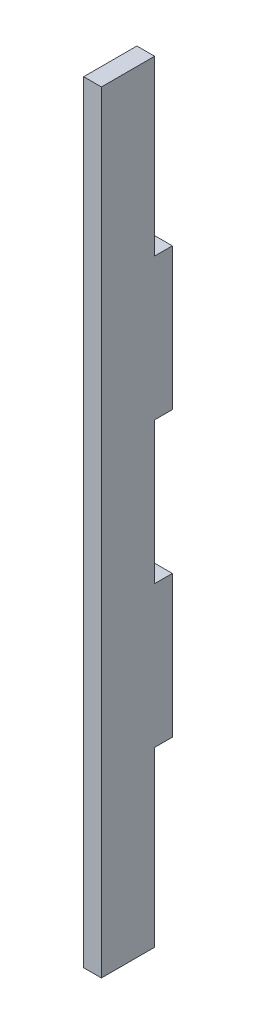
ISO-10303-21;
HEADER;
FILE_DESCRIPTION(('STEP AP214'),'2;1');
FILE_NAME('part.step','',(''),(''),'','','');
FILE_SCHEMA(('AUTOMOTIVE_DESIGN { 1 0 10303 214 1 1 1 1 }'));
ENDSEC;
DATA;
#1=APPLICATION_CONTEXT('core data for automotive mechanical design processes');
#2=APPLICATION_PROTOCOL_DEFINITION('international standard','automotive_design',2000,#1);
#3=PRODUCT_CONTEXT('',#1,'mechanical');
#4=PRODUCT('Part','Part','',(#3));
#5=PRODUCT_RELATED_PRODUCT_CATEGORY('part','',(#4));
#6=PRODUCT_DEFINITION_FORMATION('','',#4);
#7=PRODUCT_DEFINITION_CONTEXT('part definition',#1,'design');
#8=PRODUCT_DEFINITION('design','',#6,#7);
#9=PRODUCT_DEFINITION_SHAPE('','',#8);
#10=(LENGTH_UNIT() NAMED_UNIT(*) SI_UNIT(.MILLI.,.METRE.));
#11=(NAMED_UNIT(*) PLANE_ANGLE_UNIT() SI_UNIT($,.RADIAN.));
#12=(NAMED_UNIT(*) SI_UNIT($,.STERADIAN.) SOLID_ANGLE_UNIT());
#13=UNCERTAINTY_MEASURE_WITH_UNIT(LENGTH_MEASURE(1.E-05),#10,'distance_accuracy_value','');
#14=(GEOMETRIC_REPRESENTATION_CONTEXT(3) GLOBAL_UNCERTAINTY_ASSIGNED_CONTEXT((#13)) GLOBAL_UNIT_ASSIGNED_CONTEXT((#10,
#11,#12)) REPRESENTATION_CONTEXT('',''));
#15=CARTESIAN_POINT('',(0.,0.,0.));
#16=DIRECTION('',(0.,0.,1.));
#17=DIRECTION('',(1.,0.,0.));
#18=AXIS2_PLACEMENT_3D('',#15,#16,#17);
#19=CARTESIAN_POINT('',(3.175,0.,-3.175));
#20=DIRECTION('',(0.,0.,-1.));
#21=DIRECTION('',(-1.,0.,0.));
#22=AXIS2_PLACEMENT_3D('',#19,#20,#21);
#23=PLANE('',#22);
#24=DIRECTION('',(0.,-1.,0.));
#25=VECTOR('',#24,1.);
#26=CARTESIAN_POINT('',(0.,0.,-3.175));
#27=LINE('',#26,#25);
#28=CARTESIAN_POINT('',(0.,-101.6,-3.17500000000001));
#29=VERTEX_POINT('',#28);
#30=CARTESIAN_POINT('',(0.,-132.588,-3.175));
#31=VERTEX_POINT('',#30);
#32=EDGE_CURVE('E152',#29,#31,#27,.T.);
#33=ORIENTED_EDGE('',*,*,#32,.F.);
#34=DIRECTION('',(-1.,0.,0.));
#35=VECTOR('',#34,1.);
#36=CARTESIAN_POINT('',(3.175,-101.6,-3.17500000000001));
#37=LINE('',#36,#35);
#38=CARTESIAN_POINT('',(3.175,-101.6,-3.17500000000001));
#39=VERTEX_POINT('',#38);
#40=EDGE_CURVE('E11',#39,#29,#37,.T.);
#41=ORIENTED_EDGE('',*,*,#40,.F.);
#42=DIRECTION('',(0.,-1.,0.));
#43=VECTOR('',#42,1.);
#44=CARTESIAN_POINT('',(3.175,0.,-3.175));
#45=LINE('',#44,#43);
#46=CARTESIAN_POINT('',(3.175,-132.588,-3.175));
#47=VERTEX_POINT('',#46);
#48=EDGE_CURVE('E182',#39,#47,#45,.T.);
#49=ORIENTED_EDGE('',*,*,#48,.T.);
#50=DIRECTION('',(-1.,0.,0.));
#51=VECTOR('',#50,1.);
#52=CARTESIAN_POINT('',(3.175,-132.588,-3.175));
#53=LINE('',#52,#51);
#54=EDGE_CURVE('E98',#47,#31,#53,.T.);
#55=ORIENTED_EDGE('',*,*,#54,.T.);
#56=EDGE_LOOP('',(#33,#41,#49,#55));
#57=FACE_BOUND('',#56,.T.);
#58=ADVANCED_FACE('F36',(#57),#23,.T.);
#59=CARTESIAN_POINT('',(3.175,-101.6,0.));
#60=DIRECTION('',(0.,-1.,0.));
#61=DIRECTION('',(0.,0.,-1.));
#62=AXIS2_PLACEMENT_3D('',#59,#60,#61);
#63=PLANE('',#62);
#64=DIRECTION('',(0.,0.,1.));
#65=VECTOR('',#64,1.);
#66=CARTESIAN_POINT('',(0.,-101.6,0.));
#67=LINE('',#66,#65);
#68=CARTESIAN_POINT('',(0.,-101.6,-6.35));
#69=VERTEX_POINT('',#68);
#70=EDGE_CURVE('E155',#69,#29,#67,.T.);
#71=ORIENTED_EDGE('',*,*,#70,.F.);
#72=DIRECTION('',(-1.,0.,0.));
#73=VECTOR('',#72,1.);
#74=CARTESIAN_POINT('',(3.175,-101.6,-6.35));
#75=LINE('',#74,#73);
#76=CARTESIAN_POINT('',(3.175,-101.6,-6.35));
#77=VERTEX_POINT('',#76);
#78=EDGE_CURVE('E44',#77,#69,#75,.T.);
#79=ORIENTED_EDGE('',*,*,#78,.F.);
#80=DIRECTION('',(0.,0.,1.));
#81=VECTOR('',#80,1.);
#82=CARTESIAN_POINT('',(3.175,-101.6,0.));
#83=LINE('',#82,#81);
#84=EDGE_CURVE('E221',#77,#39,#83,.T.);
#85=ORIENTED_EDGE('',*,*,#84,.T.);
#86=ORIENTED_EDGE('',*,*,#40,.T.);
#87=EDGE_LOOP('',(#71,#79,#85,#86));
#88=FACE_BOUND('',#87,.T.);
#89=ADVANCED_FACE('F207',(#88),#63,.T.);
#90=CARTESIAN_POINT('',(3.175,0.,-6.35));
#91=DIRECTION('',(0.,0.,-1.));
#92=DIRECTION('',(0.,1.,0.));
#93=AXIS2_PLACEMENT_3D('',#90,#91,#92);
#94=PLANE('',#93);
#95=DIRECTION('',(0.,-1.,0.));
#96=VECTOR('',#95,1.);
#97=CARTESIAN_POINT('',(0.,0.,-6.35));
#98=LINE('',#97,#96);
#99=CARTESIAN_POINT('',(0.,-76.2,-6.35));
#100=VERTEX_POINT('',#99);
#101=EDGE_CURVE('E158',#100,#69,#98,.T.);
#102=ORIENTED_EDGE('',*,*,#101,.F.);
#103=DIRECTION('',(-1.,0.,0.));
#104=VECTOR('',#103,1.);
#105=CARTESIAN_POINT('',(3.175,-76.2,-6.35));
#106=LINE('',#105,#104);
#107=CARTESIAN_POINT('',(3.175,-76.2,-6.35));
#108=VERTEX_POINT('',#107);
#109=EDGE_CURVE('E196',#108,#100,#106,.T.);
#110=ORIENTED_EDGE('',*,*,#109,.F.);
#111=DIRECTION('',(0.,-1.,0.));
#112=VECTOR('',#111,1.);
#113=CARTESIAN_POINT('',(3.175,0.,-6.35));
#114=LINE('',#113,#112);
#115=EDGE_CURVE('E203',#108,#77,#114,.T.);
#116=ORIENTED_EDGE('',*,*,#115,.T.);
#117=ORIENTED_EDGE('',*,*,#78,.T.);
#118=EDGE_LOOP('',(#102,#110,#116,#117));
#119=FACE_BOUND('',#118,.T.);
#120=ADVANCED_FACE('F201',(#119),#94,.T.);
#121=CARTESIAN_POINT('',(3.175,-76.2,0.));
#122=DIRECTION('',(0.,-1.,0.));
#123=DIRECTION('',(0.,0.,-1.));
#124=AXIS2_PLACEMENT_3D('',#121,#122,#123);
#125=PLANE('',#124);
#126=DIRECTION('',(0.,0.,1.));
#127=VECTOR('',#126,1.);
#128=CARTESIAN_POINT('',(0.,-76.2,0.));
#129=LINE('',#128,#127);
#130=CARTESIAN_POINT('',(0.,-76.2,-3.175));
#131=VERTEX_POINT('',#130);
#132=EDGE_CURVE('E161',#100,#131,#129,.T.);
#133=ORIENTED_EDGE('',*,*,#132,.T.);
#134=DIRECTION('',(-1.,0.,0.));
#135=VECTOR('',#134,1.);
#136=CARTESIAN_POINT('',(3.175,-76.2,-3.175));
#137=LINE('',#136,#135);
#138=CARTESIAN_POINT('',(3.175,-76.2,-3.175));
#139=VERTEX_POINT('',#138);
#140=EDGE_CURVE('E194',#139,#131,#137,.T.);
#141=ORIENTED_EDGE('',*,*,#140,.F.);
#142=DIRECTION('',(0.,0.,1.));
#143=VECTOR('',#142,1.);
#144=CARTESIAN_POINT('',(3.175,-76.2,0.));
#145=LINE('',#144,#143);
#146=EDGE_CURVE('E217',#108,#139,#145,.T.);
#147=ORIENTED_EDGE('',*,*,#146,.F.);
#148=ORIENTED_EDGE('',*,*,#109,.T.);
#149=EDGE_LOOP('',(#133,#141,#147,#148));
#150=FACE_BOUND('',#149,.T.);
#151=ADVANCED_FACE('F214',(#150),#125,.F.);
#152=CARTESIAN_POINT('',(3.175,0.,-3.17499999999999));
#153=DIRECTION('',(0.,0.,-1.));
#154=DIRECTION('',(0.,1.,0.));
#155=AXIS2_PLACEMENT_3D('',#152,#153,#154);
#156=PLANE('',#155);
#157=DIRECTION('',(0.,-1.,0.));
#158=VECTOR('',#157,1.);
#159=CARTESIAN_POINT('',(0.,0.,-3.17499999999999));
#160=LINE('',#159,#158);
#161=CARTESIAN_POINT('',(0.,-50.8,-3.175));
#162=VERTEX_POINT('',#161);
#163=EDGE_CURVE('E165',#162,#131,#160,.T.);
#164=ORIENTED_EDGE('',*,*,#163,.F.);
#165=DIRECTION('',(-1.,0.,0.));
#166=VECTOR('',#165,1.);
#167=CARTESIAN_POINT('',(3.175,-50.8,-3.175));
#168=LINE('',#167,#166);
#169=CARTESIAN_POINT('',(3.175,-50.8,-3.175));
#170=VERTEX_POINT('',#169);
#171=EDGE_CURVE('E192',#170,#162,#168,.T.);
#172=ORIENTED_EDGE('',*,*,#171,.F.);
#173=DIRECTION('',(0.,-1.,0.));
#174=VECTOR('',#173,1.);
#175=CARTESIAN_POINT('',(3.175,0.,-3.17499999999999));
#176=LINE('',#175,#174);
#177=EDGE_CURVE('E219',#170,#139,#176,.T.);
#178=ORIENTED_EDGE('',*,*,#177,.T.);
#179=ORIENTED_EDGE('',*,*,#140,.T.);
#180=EDGE_LOOP('',(#164,#172,#178,#179));
#181=FACE_BOUND('',#180,.T.);
#182=ADVANCED_FACE('F255',(#181),#156,.T.);
#183=CARTESIAN_POINT('',(3.175,-50.8,0.));
#184=DIRECTION('',(0.,-1.,0.));
#185=DIRECTION('',(0.,0.,-1.));
#186=AXIS2_PLACEMENT_3D('',#183,#184,#185);
#187=PLANE('',#186);
#188=DIRECTION('',(0.,0.,1.));
#189=VECTOR('',#188,1.);
#190=CARTESIAN_POINT('',(0.,-50.8,0.));
#191=LINE('',#190,#189);
#192=CARTESIAN_POINT('',(0.,-50.8,-6.35));
#193=VERTEX_POINT('',#192);
#194=EDGE_CURVE('E168',#193,#162,#191,.T.);
#195=ORIENTED_EDGE('',*,*,#194,.F.);
#196=DIRECTION('',(-1.,0.,0.));
#197=VECTOR('',#196,1.);
#198=CARTESIAN_POINT('',(3.175,-50.8,-6.35));
#199=LINE('',#198,#197);
#200=CARTESIAN_POINT('',(3.175,-50.8,-6.35));
#201=VERTEX_POINT('',#200);
#202=EDGE_CURVE('E190',#201,#193,#199,.T.);
#203=ORIENTED_EDGE('',*,*,#202,.F.);
#204=DIRECTION('',(0.,0.,1.));
#205=VECTOR('',#204,1.);
#206=CARTESIAN_POINT('',(3.175,-50.8,0.));
#207=LINE('',#206,#205);
#208=EDGE_CURVE('E227',#201,#170,#207,.T.);
#209=ORIENTED_EDGE('',*,*,#208,.T.);
#210=ORIENTED_EDGE('',*,*,#171,.T.);
#211=EDGE_LOOP('',(#195,#203,#209,#210));
#212=FACE_BOUND('',#211,.T.);
#213=ADVANCED_FACE('F258',(#212),#187,.T.);
#214=CARTESIAN_POINT('',(0.,-25.4,-6.35));
#215=VERTEX_POINT('',#214);
#216=EDGE_CURVE('E162',#215,#193,#98,.T.);
#217=ORIENTED_EDGE('',*,*,#216,.F.);
#218=DIRECTION('',(-1.,0.,0.));
#219=VECTOR('',#218,1.);
#220=CARTESIAN_POINT('',(3.175,-25.4,-6.35));
#221=LINE('',#220,#219);
#222=CARTESIAN_POINT('',(3.175,-25.4,-6.35));
#223=VERTEX_POINT('',#222);
#224=EDGE_CURVE('E188',#223,#215,#221,.T.);
#225=ORIENTED_EDGE('',*,*,#224,.F.);
#226=EDGE_CURVE('E223',#223,#201,#114,.T.);
#227=ORIENTED_EDGE('',*,*,#226,.T.);
#228=ORIENTED_EDGE('',*,*,#202,.T.);
#229=EDGE_LOOP('',(#217,#225,#227,#228));
#230=FACE_BOUND('',#229,.T.);
#231=ADVANCED_FACE('F251',(#230),#94,.T.);
#232=CARTESIAN_POINT('',(3.175,-25.4,0.));
#233=DIRECTION('',(0.,-1.,0.));
#234=DIRECTION('',(0.,0.,-1.));
#235=AXIS2_PLACEMENT_3D('',#232,#233,#234);
#236=PLANE('',#235);
#237=DIRECTION('',(0.,0.,1.));
#238=VECTOR('',#237,1.);
#239=CARTESIAN_POINT('',(0.,-25.4,0.));
#240=LINE('',#239,#238);
#241=CARTESIAN_POINT('',(0.,-25.4,-3.175));
#242=VERTEX_POINT('',#241);
#243=EDGE_CURVE('E171',#215,#242,#240,.T.);
#244=ORIENTED_EDGE('',*,*,#243,.T.);
#245=DIRECTION('',(-1.,0.,0.));
#246=VECTOR('',#245,1.);
#247=CARTESIAN_POINT('',(3.175,-25.4,-3.175));
#248=LINE('',#247,#246);
#249=CARTESIAN_POINT('',(3.175,-25.4,-3.175));
#250=VERTEX_POINT('',#249);
#251=EDGE_CURVE('E186',#250,#242,#248,.T.);
#252=ORIENTED_EDGE('',*,*,#251,.F.);
#253=DIRECTION('',(0.,0.,1.));
#254=VECTOR('',#253,1.);
#255=CARTESIAN_POINT('',(3.175,-25.4,0.));
#256=LINE('',#255,#254);
#257=EDGE_CURVE('E226',#223,#250,#256,.T.);
#258=ORIENTED_EDGE('',*,*,#257,.F.);
#259=ORIENTED_EDGE('',*,*,#224,.T.);
#260=EDGE_LOOP('',(#244,#252,#258,#259));
#261=FACE_BOUND('',#260,.T.);
#262=ADVANCED_FACE('F263',(#261),#236,.F.);
#263=CARTESIAN_POINT('',(3.175,0.,-3.175));
#264=DIRECTION('',(0.,0.,-1.));
#265=DIRECTION('',(0.,1.,0.));
#266=AXIS2_PLACEMENT_3D('',#263,#264,#265);
#267=PLANE('',#266);
#268=DIRECTION('',(0.,-1.,0.));
#269=VECTOR('',#268,1.);
#270=CARTESIAN_POINT('',(0.,0.,-3.175));
#271=LINE('',#270,#269);
#272=CARTESIAN_POINT('',(0.,5.58800000000001,-3.175));
#273=VERTEX_POINT('',#272);
#274=EDGE_CURVE('E174',#273,#242,#271,.T.);
#275=ORIENTED_EDGE('',*,*,#274,.F.);
#276=DIRECTION('',(-1.,0.,0.));
#277=VECTOR('',#276,1.);
#278=CARTESIAN_POINT('',(3.175,5.58800000000001,-3.175));
#279=LINE('',#278,#277);
#280=CARTESIAN_POINT('',(3.175,5.58800000000001,-3.175));
#281=VERTEX_POINT('',#280);
#282=EDGE_CURVE('E139',#281,#273,#279,.T.);
#283=ORIENTED_EDGE('',*,*,#282,.F.);
#284=DIRECTION('',(0.,-1.,0.));
#285=VECTOR('',#284,1.);
#286=CARTESIAN_POINT('',(3.175,0.,-3.175));
#287=LINE('',#286,#285);
#288=EDGE_CURVE('E145',#281,#250,#287,.T.);
#289=ORIENTED_EDGE('',*,*,#288,.T.);
#290=ORIENTED_EDGE('',*,*,#251,.T.);
#291=EDGE_LOOP('',(#275,#283,#289,#290));
#292=FACE_BOUND('',#291,.T.);
#293=ADVANCED_FACE('F238',(#292),#267,.T.);
#294=CARTESIAN_POINT('',(3.175,5.58800000000001,0.));
#295=DIRECTION('',(0.,1.,0.));
#296=DIRECTION('',(0.,0.,1.));
#297=AXIS2_PLACEMENT_3D('',#294,#295,#296);
#298=PLANE('',#297);
#299=DIRECTION('',(0.,0.,-1.));
#300=VECTOR('',#299,1.);
#301=CARTESIAN_POINT('',(0.,5.58800000000001,0.));
#302=LINE('',#301,#300);
#303=CARTESIAN_POINT('',(0.,5.58800000000001,6.35));
#304=VERTEX_POINT('',#303);
#305=EDGE_CURVE('E134',#304,#273,#302,.T.);
#306=ORIENTED_EDGE('',*,*,#305,.F.);
#307=DIRECTION('',(-1.,0.,0.));
#308=VECTOR('',#307,1.);
#309=CARTESIAN_POINT('',(3.175,5.58800000000001,6.35));
#310=LINE('',#309,#308);
#311=CARTESIAN_POINT('',(3.175,5.58800000000001,6.35));
#312=VERTEX_POINT('',#311);
#313=EDGE_CURVE('E129',#312,#304,#310,.T.);
#314=ORIENTED_EDGE('',*,*,#313,.F.);
#315=DIRECTION('',(0.,0.,-1.));
#316=VECTOR('',#315,1.);
#317=CARTESIAN_POINT('',(3.175,5.58800000000001,0.));
#318=LINE('',#317,#316);
#319=EDGE_CURVE('E132',#312,#281,#318,.T.);
#320=ORIENTED_EDGE('',*,*,#319,.T.);
#321=ORIENTED_EDGE('',*,*,#282,.T.);
#322=EDGE_LOOP('',(#306,#314,#320,#321));
#323=FACE_BOUND('',#322,.T.);
#324=ADVANCED_FACE('F131',(#323),#298,.T.);
#325=CARTESIAN_POINT('',(3.175,0.,6.35));
#326=DIRECTION('',(0.,0.,1.));
#327=DIRECTION('',(1.,0.,0.));
#328=AXIS2_PLACEMENT_3D('',#325,#326,#327);
#329=PLANE('',#328);
#330=DIRECTION('',(0.,1.,0.));
#331=VECTOR('',#330,1.);
#332=CARTESIAN_POINT('',(0.,0.,6.35));
#333=LINE('',#332,#331);
#334=CARTESIAN_POINT('',(0.,-132.588,6.35));
#335=VERTEX_POINT('',#334);
#336=EDGE_CURVE('E178',#335,#304,#333,.T.);
#337=ORIENTED_EDGE('',*,*,#336,.F.);
#338=DIRECTION('',(-1.,0.,0.));
#339=VECTOR('',#338,1.);
#340=CARTESIAN_POINT('',(3.175,-132.588,6.35));
#341=LINE('',#340,#339);
#342=CARTESIAN_POINT('',(3.175,-132.588,6.35));
#343=VERTEX_POINT('',#342);
#344=EDGE_CURVE('E91',#343,#335,#341,.T.);
#345=ORIENTED_EDGE('',*,*,#344,.F.);
#346=DIRECTION('',(0.,1.,0.));
#347=VECTOR('',#346,1.);
#348=CARTESIAN_POINT('',(3.175,0.,6.35));
#349=LINE('',#348,#347);
#350=EDGE_CURVE('E143',#343,#312,#349,.T.);
#351=ORIENTED_EDGE('',*,*,#350,.T.);
#352=ORIENTED_EDGE('',*,*,#313,.T.);
#353=EDGE_LOOP('',(#337,#345,#351,#352));
#354=FACE_BOUND('',#353,.T.);
#355=ADVANCED_FACE('F147',(#354),#329,.T.);
#356=CARTESIAN_POINT('',(3.175,-132.588,0.));
#357=DIRECTION('',(0.,1.,0.));
#358=DIRECTION('',(0.,0.,1.));
#359=AXIS2_PLACEMENT_3D('',#356,#357,#358);
#360=PLANE('',#359);
#361=DIRECTION('',(0.,0.,-1.));
#362=VECTOR('',#361,1.);
#363=CARTESIAN_POINT('',(0.,-132.588,0.));
#364=LINE('',#363,#362);
#365=EDGE_CURVE('E180',#335,#31,#364,.T.);
#366=ORIENTED_EDGE('',*,*,#365,.T.);
#367=ORIENTED_EDGE('',*,*,#54,.F.);
#368=DIRECTION('',(0.,0.,-1.));
#369=VECTOR('',#368,1.);
#370=CARTESIAN_POINT('',(3.175,-132.588,0.));
#371=LINE('',#370,#369);
#372=EDGE_CURVE('E52',#343,#47,#371,.T.);
#373=ORIENTED_EDGE('',*,*,#372,.F.);
#374=ORIENTED_EDGE('',*,*,#344,.T.);
#375=EDGE_LOOP('',(#366,#367,#373,#374));
#376=FACE_BOUND('',#375,.T.);
#377=ADVANCED_FACE('F241',(#376),#360,.F.);
#378=CARTESIAN_POINT('',(3.175,0.,0.));
#379=DIRECTION('',(1.,0.,0.));
#380=DIRECTION('',(0.,0.,-1.));
#381=AXIS2_PLACEMENT_3D('',#378,#379,#380);
#382=PLANE('',#381);
#383=ORIENTED_EDGE('',*,*,#48,.F.);
#384=ORIENTED_EDGE('',*,*,#84,.F.);
#385=ORIENTED_EDGE('',*,*,#115,.F.);
#386=ORIENTED_EDGE('',*,*,#146,.T.);
#387=ORIENTED_EDGE('',*,*,#177,.F.);
#388=ORIENTED_EDGE('',*,*,#208,.F.);
#389=ORIENTED_EDGE('',*,*,#226,.F.);
#390=ORIENTED_EDGE('',*,*,#257,.T.);
#391=ORIENTED_EDGE('',*,*,#288,.F.);
#392=ORIENTED_EDGE('',*,*,#319,.F.);
#393=ORIENTED_EDGE('',*,*,#350,.F.);
#394=ORIENTED_EDGE('',*,*,#372,.T.);
#395=EDGE_LOOP('',(#383,#384,#385,#386,#387,#388,#389,#390,#391,#392,#393,#394));
#396=FACE_BOUND('',#395,.T.);
#397=ADVANCED_FACE('F142',(#396),#382,.T.);
#398=CARTESIAN_POINT('',(0.,0.,0.));
#399=DIRECTION('',(1.,0.,0.));
#400=DIRECTION('',(0.,0.,-1.));
#401=AXIS2_PLACEMENT_3D('',#398,#399,#400);
#402=PLANE('',#401);
#403=ORIENTED_EDGE('',*,*,#32,.T.);
#404=ORIENTED_EDGE('',*,*,#365,.F.);
#405=ORIENTED_EDGE('',*,*,#336,.T.);
#406=ORIENTED_EDGE('',*,*,#305,.T.);
#407=ORIENTED_EDGE('',*,*,#274,.T.);
#408=ORIENTED_EDGE('',*,*,#243,.F.);
#409=ORIENTED_EDGE('',*,*,#216,.T.);
#410=ORIENTED_EDGE('',*,*,#194,.T.);
#411=ORIENTED_EDGE('',*,*,#163,.T.);
#412=ORIENTED_EDGE('',*,*,#132,.F.);
#413=ORIENTED_EDGE('',*,*,#101,.T.);
#414=ORIENTED_EDGE('',*,*,#70,.T.);
#415=EDGE_LOOP('',(#403,#404,#405,#406,#407,#408,#409,#410,#411,#412,#413,#414));
#416=FACE_BOUND('',#415,.T.);
#417=ADVANCED_FACE('F210',(#416),#402,.F.);
#418=CLOSED_SHELL('',(#58,#89,#120,#151,#182,#213,#231,#262,#293,#324,#355,#377,#397,#417));
#419=MANIFOLD_SOLID_BREP('B2',#418);
#420=ADVANCED_BREP_SHAPE_REPRESENTATION('',(#18,#419),#14);
#421=SHAPE_DEFINITION_REPRESENTATION(#9,#420);
ENDSEC;
END-ISO-10303-21;
